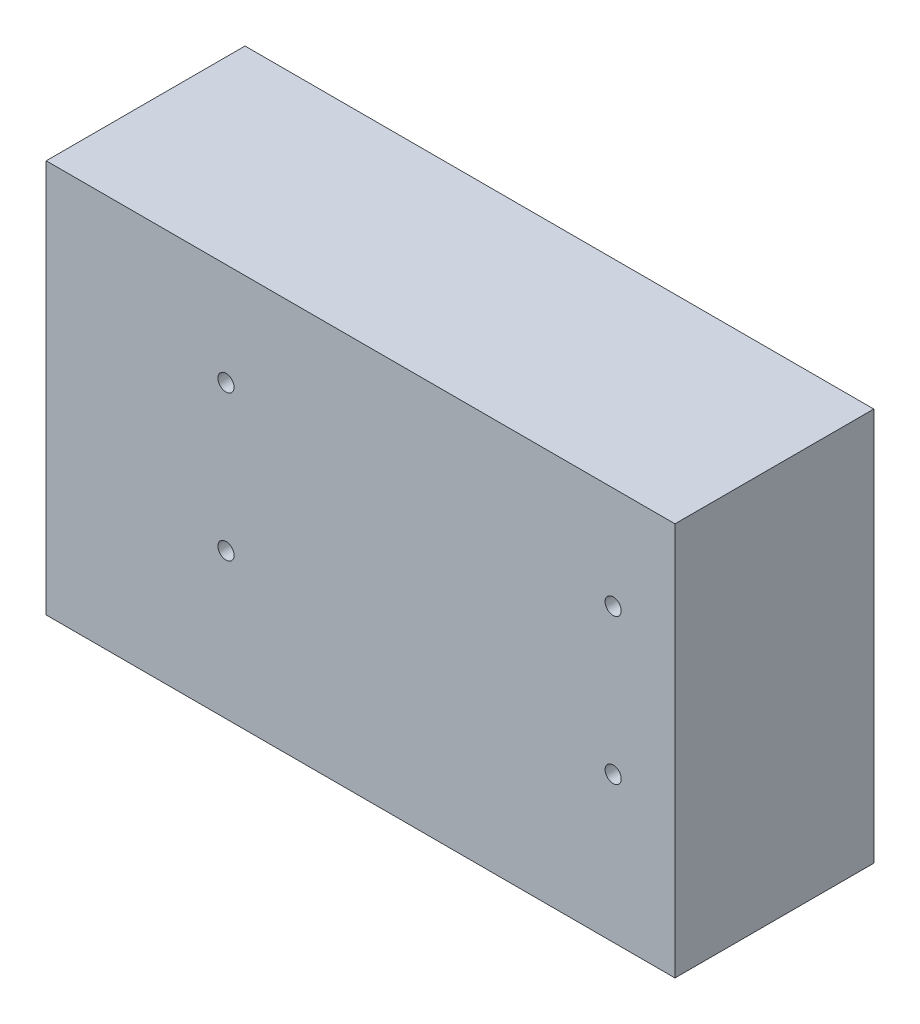
ISO-10303-21;
HEADER;
FILE_DESCRIPTION(('STEP AP214'),'2;1');
FILE_NAME('part.step','',(''),(''),'','','');
FILE_SCHEMA(('AUTOMOTIVE_DESIGN { 1 0 10303 214 1 1 1 1 }'));
ENDSEC;
DATA;
#1=APPLICATION_CONTEXT('core data for automotive mechanical design processes');
#2=APPLICATION_PROTOCOL_DEFINITION('international standard','automotive_design',2000,#1);
#3=PRODUCT_CONTEXT('',#1,'mechanical');
#4=PRODUCT('Part','Part','',(#3));
#5=PRODUCT_RELATED_PRODUCT_CATEGORY('part','',(#4));
#6=PRODUCT_DEFINITION_FORMATION('','',#4);
#7=PRODUCT_DEFINITION_CONTEXT('part definition',#1,'design');
#8=PRODUCT_DEFINITION('design','',#6,#7);
#9=PRODUCT_DEFINITION_SHAPE('','',#8);
#10=(LENGTH_UNIT() NAMED_UNIT(*) SI_UNIT(.MILLI.,.METRE.));
#11=(NAMED_UNIT(*) PLANE_ANGLE_UNIT() SI_UNIT($,.RADIAN.));
#12=(NAMED_UNIT(*) SI_UNIT($,.STERADIAN.) SOLID_ANGLE_UNIT());
#13=UNCERTAINTY_MEASURE_WITH_UNIT(LENGTH_MEASURE(1.E-05),#10,'distance_accuracy_value','');
#14=(GEOMETRIC_REPRESENTATION_CONTEXT(3) GLOBAL_UNCERTAINTY_ASSIGNED_CONTEXT((#13)) GLOBAL_UNIT_ASSIGNED_CONTEXT((#10,
#11,#12)) REPRESENTATION_CONTEXT('',''));
#15=CARTESIAN_POINT('',(0.,0.,0.));
#16=DIRECTION('',(0.,0.,1.));
#17=DIRECTION('',(1.,0.,0.));
#18=AXIS2_PLACEMENT_3D('',#15,#16,#17);
#19=CARTESIAN_POINT('',(33.05,20.675,20.9));
#20=DIRECTION('',(-1.,0.,0.));
#21=DIRECTION('',(0.,-1.,0.));
#22=AXIS2_PLACEMENT_3D('',#19,#20,#21);
#23=PLANE('',#22);
#24=DIRECTION('',(0.,1.,0.));
#25=VECTOR('',#24,1.);
#26=CARTESIAN_POINT('',(33.05,20.675,0.));
#27=LINE('',#26,#25);
#28=CARTESIAN_POINT('',(33.05,-20.675,0.));
#29=VERTEX_POINT('',#28);
#30=CARTESIAN_POINT('',(33.05,20.675,0.));
#31=VERTEX_POINT('',#30);
#32=EDGE_CURVE('E103',#29,#31,#27,.T.);
#33=ORIENTED_EDGE('',*,*,#32,.T.);
#34=DIRECTION('',(0.,0.,-1.));
#35=VECTOR('',#34,1.);
#36=CARTESIAN_POINT('',(33.05,20.675,20.9));
#37=LINE('',#36,#35);
#38=CARTESIAN_POINT('',(33.05,20.675,20.9));
#39=VERTEX_POINT('',#38);
#40=EDGE_CURVE('E11',#39,#31,#37,.T.);
#41=ORIENTED_EDGE('',*,*,#40,.F.);
#42=DIRECTION('',(0.,1.,0.));
#43=VECTOR('',#42,1.);
#44=CARTESIAN_POINT('',(33.05,20.675,20.9));
#45=LINE('',#44,#43);
#46=CARTESIAN_POINT('',(33.05,-20.675,20.9));
#47=VERTEX_POINT('',#46);
#48=EDGE_CURVE('E91',#47,#39,#45,.T.);
#49=ORIENTED_EDGE('',*,*,#48,.F.);
#50=DIRECTION('',(0.,0.,-1.));
#51=VECTOR('',#50,1.);
#52=CARTESIAN_POINT('',(33.05,-20.675,20.9));
#53=LINE('',#52,#51);
#54=EDGE_CURVE('E99',#47,#29,#53,.T.);
#55=ORIENTED_EDGE('',*,*,#54,.T.);
#56=EDGE_LOOP('',(#33,#41,#49,#55));
#57=FACE_BOUND('',#56,.T.);
#58=ADVANCED_FACE('F40',(#57),#23,.F.);
#59=CARTESIAN_POINT('',(-33.05,20.675,20.9));
#60=DIRECTION('',(0.,-1.,0.));
#61=DIRECTION('',(1.,0.,0.));
#62=AXIS2_PLACEMENT_3D('',#59,#60,#61);
#63=PLANE('',#62);
#64=DIRECTION('',(-1.,0.,0.));
#65=VECTOR('',#64,1.);
#66=CARTESIAN_POINT('',(-33.05,20.675,0.));
#67=LINE('',#66,#65);
#68=CARTESIAN_POINT('',(-33.05,20.675,0.));
#69=VERTEX_POINT('',#68);
#70=EDGE_CURVE('E95',#31,#69,#67,.T.);
#71=ORIENTED_EDGE('',*,*,#70,.T.);
#72=DIRECTION('',(0.,0.,-1.));
#73=VECTOR('',#72,1.);
#74=CARTESIAN_POINT('',(-33.05,20.675,20.9));
#75=LINE('',#74,#73);
#76=CARTESIAN_POINT('',(-33.05,20.675,20.9));
#77=VERTEX_POINT('',#76);
#78=EDGE_CURVE('E48',#77,#69,#75,.T.);
#79=ORIENTED_EDGE('',*,*,#78,.F.);
#80=DIRECTION('',(-1.,0.,0.));
#81=VECTOR('',#80,1.);
#82=CARTESIAN_POINT('',(-33.05,20.675,20.9));
#83=LINE('',#82,#81);
#84=EDGE_CURVE('E86',#39,#77,#83,.T.);
#85=ORIENTED_EDGE('',*,*,#84,.F.);
#86=ORIENTED_EDGE('',*,*,#40,.T.);
#87=EDGE_LOOP('',(#71,#79,#85,#86));
#88=FACE_BOUND('',#87,.T.);
#89=ADVANCED_FACE('F94',(#88),#63,.F.);
#90=CARTESIAN_POINT('',(-33.05,20.675,20.9));
#91=DIRECTION('',(1.,0.,0.));
#92=DIRECTION('',(0.,1.,0.));
#93=AXIS2_PLACEMENT_3D('',#90,#91,#92);
#94=PLANE('',#93);
#95=DIRECTION('',(0.,-1.,0.));
#96=VECTOR('',#95,1.);
#97=CARTESIAN_POINT('',(-33.05,20.675,0.));
#98=LINE('',#97,#96);
#99=CARTESIAN_POINT('',(-33.05,-20.675,0.));
#100=VERTEX_POINT('',#99);
#101=EDGE_CURVE('E73',#69,#100,#98,.T.);
#102=ORIENTED_EDGE('',*,*,#101,.T.);
#103=DIRECTION('',(0.,0.,-1.));
#104=VECTOR('',#103,1.);
#105=CARTESIAN_POINT('',(-33.05,-20.675,20.9));
#106=LINE('',#105,#104);
#107=CARTESIAN_POINT('',(-33.05,-20.675,20.9));
#108=VERTEX_POINT('',#107);
#109=EDGE_CURVE('E96',#108,#100,#106,.T.);
#110=ORIENTED_EDGE('',*,*,#109,.F.);
#111=DIRECTION('',(0.,-1.,0.));
#112=VECTOR('',#111,1.);
#113=CARTESIAN_POINT('',(-33.05,20.675,20.9));
#114=LINE('',#113,#112);
#115=EDGE_CURVE('E89',#77,#108,#114,.T.);
#116=ORIENTED_EDGE('',*,*,#115,.F.);
#117=ORIENTED_EDGE('',*,*,#78,.T.);
#118=EDGE_LOOP('',(#102,#110,#116,#117));
#119=FACE_BOUND('',#118,.T.);
#120=ADVANCED_FACE('F97',(#119),#94,.F.);
#121=CARTESIAN_POINT('',(-33.05,-20.675,20.9));
#122=DIRECTION('',(0.,1.,0.));
#123=DIRECTION('',(0.,0.,1.));
#124=AXIS2_PLACEMENT_3D('',#121,#122,#123);
#125=PLANE('',#124);
#126=DIRECTION('',(1.,0.,0.));
#127=VECTOR('',#126,1.);
#128=CARTESIAN_POINT('',(-33.05,-20.675,0.));
#129=LINE('',#128,#127);
#130=EDGE_CURVE('E79',#100,#29,#129,.T.);
#131=ORIENTED_EDGE('',*,*,#130,.T.);
#132=ORIENTED_EDGE('',*,*,#54,.F.);
#133=DIRECTION('',(1.,0.,0.));
#134=VECTOR('',#133,1.);
#135=CARTESIAN_POINT('',(-33.05,-20.675,20.9));
#136=LINE('',#135,#134);
#137=EDGE_CURVE('E56',#108,#47,#136,.T.);
#138=ORIENTED_EDGE('',*,*,#137,.F.);
#139=ORIENTED_EDGE('',*,*,#109,.T.);
#140=EDGE_LOOP('',(#131,#132,#138,#139));
#141=FACE_BOUND('',#140,.T.);
#142=ADVANCED_FACE('F111',(#141),#125,.F.);
#143=CARTESIAN_POINT('',(0.,0.,20.9));
#144=DIRECTION('',(0.,0.,1.));
#145=DIRECTION('',(1.,0.,0.));
#146=AXIS2_PLACEMENT_3D('',#143,#144,#145);
#147=PLANE('',#146);
#148=CARTESIAN_POINT('',(-14.15,9.925,20.9));
#149=DIRECTION('',(0.,0.,1.));
#150=DIRECTION('',(1.,0.,0.));
#151=AXIS2_PLACEMENT_3D('',#148,#149,#150);
#152=CIRCLE('',#151,0.85);
#153=CARTESIAN_POINT('',(-13.3,9.925,20.9));
#154=VERTEX_POINT('',#153);
#155=EDGE_CURVE('E106',#154,#154,#152,.T.);
#156=ORIENTED_EDGE('',*,*,#155,.F.);
#157=EDGE_LOOP('',(#156));
#158=FACE_BOUND('',#157,.T.);
#159=CARTESIAN_POINT('',(26.55,-5.375,20.9));
#160=DIRECTION('',(0.,0.,1.));
#161=DIRECTION('',(1.,0.,0.));
#162=AXIS2_PLACEMENT_3D('',#159,#160,#161);
#163=CIRCLE('',#162,0.85);
#164=CARTESIAN_POINT('',(27.4,-5.375,20.9));
#165=VERTEX_POINT('',#164);
#166=EDGE_CURVE('E119',#165,#165,#163,.T.);
#167=ORIENTED_EDGE('',*,*,#166,.F.);
#168=EDGE_LOOP('',(#167));
#169=FACE_BOUND('',#168,.T.);
#170=CARTESIAN_POINT('',(-14.15,-5.375,20.9));
#171=DIRECTION('',(0.,0.,1.));
#172=DIRECTION('',(1.,0.,0.));
#173=AXIS2_PLACEMENT_3D('',#170,#171,#172);
#174=CIRCLE('',#173,0.85);
#175=CARTESIAN_POINT('',(-13.3,-5.375,20.9));
#176=VERTEX_POINT('',#175);
#177=EDGE_CURVE('E122',#176,#176,#174,.T.);
#178=ORIENTED_EDGE('',*,*,#177,.F.);
#179=EDGE_LOOP('',(#178));
#180=FACE_BOUND('',#179,.T.);
#181=CARTESIAN_POINT('',(26.55,9.925,20.9));
#182=DIRECTION('',(0.,0.,1.));
#183=DIRECTION('',(1.,0.,0.));
#184=AXIS2_PLACEMENT_3D('',#181,#182,#183);
#185=CIRCLE('',#184,0.85);
#186=CARTESIAN_POINT('',(27.4,9.925,20.9));
#187=VERTEX_POINT('',#186);
#188=EDGE_CURVE('E125',#187,#187,#185,.T.);
#189=ORIENTED_EDGE('',*,*,#188,.F.);
#190=EDGE_LOOP('',(#189));
#191=FACE_BOUND('',#190,.T.);
#192=ORIENTED_EDGE('',*,*,#48,.T.);
#193=ORIENTED_EDGE('',*,*,#84,.T.);
#194=ORIENTED_EDGE('',*,*,#115,.T.);
#195=ORIENTED_EDGE('',*,*,#137,.T.);
#196=EDGE_LOOP('',(#192,#193,#194,#195));
#197=FACE_BOUND('',#196,.T.);
#198=ADVANCED_FACE('F87',(#158,#169,#180,#191,#197),#147,.T.);
#199=CARTESIAN_POINT('',(0.,0.,0.));
#200=DIRECTION('',(0.,0.,1.));
#201=DIRECTION('',(1.,0.,0.));
#202=AXIS2_PLACEMENT_3D('',#199,#200,#201);
#203=PLANE('',#202);
#204=CARTESIAN_POINT('',(-14.15,9.925,0.));
#205=DIRECTION('',(0.,0.,-1.));
#206=DIRECTION('',(-1.,0.,0.));
#207=AXIS2_PLACEMENT_3D('',#204,#205,#206);
#208=CIRCLE('',#207,0.85);
#209=CARTESIAN_POINT('',(-15.,9.925,0.));
#210=VERTEX_POINT('',#209);
#211=EDGE_CURVE('E131',#210,#210,#208,.T.);
#212=ORIENTED_EDGE('',*,*,#211,.F.);
#213=EDGE_LOOP('',(#212));
#214=FACE_BOUND('',#213,.T.);
#215=CARTESIAN_POINT('',(26.55,-5.375,0.));
#216=DIRECTION('',(0.,0.,-1.));
#217=DIRECTION('',(-1.,0.,0.));
#218=AXIS2_PLACEMENT_3D('',#215,#216,#217);
#219=CIRCLE('',#218,0.85);
#220=CARTESIAN_POINT('',(25.7,-5.375,0.));
#221=VERTEX_POINT('',#220);
#222=EDGE_CURVE('E132',#221,#221,#219,.T.);
#223=ORIENTED_EDGE('',*,*,#222,.F.);
#224=EDGE_LOOP('',(#223));
#225=FACE_BOUND('',#224,.T.);
#226=CARTESIAN_POINT('',(-14.15,-5.375,0.));
#227=DIRECTION('',(0.,0.,-1.));
#228=DIRECTION('',(-1.,0.,0.));
#229=AXIS2_PLACEMENT_3D('',#226,#227,#228);
#230=CIRCLE('',#229,0.85);
#231=CARTESIAN_POINT('',(-15.,-5.375,0.));
#232=VERTEX_POINT('',#231);
#233=EDGE_CURVE('E135',#232,#232,#230,.T.);
#234=ORIENTED_EDGE('',*,*,#233,.F.);
#235=EDGE_LOOP('',(#234));
#236=FACE_BOUND('',#235,.T.);
#237=CARTESIAN_POINT('',(26.55,9.925,0.));
#238=DIRECTION('',(0.,0.,-1.));
#239=DIRECTION('',(-1.,0.,0.));
#240=AXIS2_PLACEMENT_3D('',#237,#238,#239);
#241=CIRCLE('',#240,0.85);
#242=CARTESIAN_POINT('',(25.7,9.925,0.));
#243=VERTEX_POINT('',#242);
#244=EDGE_CURVE('E128',#243,#243,#241,.T.);
#245=ORIENTED_EDGE('',*,*,#244,.F.);
#246=EDGE_LOOP('',(#245));
#247=FACE_BOUND('',#246,.T.);
#248=ORIENTED_EDGE('',*,*,#32,.F.);
#249=ORIENTED_EDGE('',*,*,#130,.F.);
#250=ORIENTED_EDGE('',*,*,#101,.F.);
#251=ORIENTED_EDGE('',*,*,#70,.F.);
#252=EDGE_LOOP('',(#248,#249,#250,#251));
#253=FACE_BOUND('',#252,.T.);
#254=ADVANCED_FACE('F114',(#214,#225,#236,#247,#253),#203,.F.);
#255=CARTESIAN_POINT('',(26.55,9.925,30.));
#256=DIRECTION('',(0.,0.,-1.));
#257=DIRECTION('',(-1.,0.,0.));
#258=AXIS2_PLACEMENT_3D('',#255,#256,#257);
#259=CYLINDRICAL_SURFACE('',#258,0.85);
#260=ORIENTED_EDGE('',*,*,#188,.T.);
#261=EDGE_LOOP('',(#260));
#262=FACE_BOUND('',#261,.T.);
#263=ORIENTED_EDGE('',*,*,#244,.T.);
#264=EDGE_LOOP('',(#263));
#265=FACE_BOUND('',#264,.T.);
#266=ADVANCED_FACE('F145',(#262,#265),#259,.F.);
#267=CARTESIAN_POINT('',(-14.15,-5.375,30.));
#268=DIRECTION('',(0.,0.,-1.));
#269=DIRECTION('',(-1.,0.,0.));
#270=AXIS2_PLACEMENT_3D('',#267,#268,#269);
#271=CYLINDRICAL_SURFACE('',#270,0.85);
#272=ORIENTED_EDGE('',*,*,#177,.T.);
#273=EDGE_LOOP('',(#272));
#274=FACE_BOUND('',#273,.T.);
#275=ORIENTED_EDGE('',*,*,#233,.T.);
#276=EDGE_LOOP('',(#275));
#277=FACE_BOUND('',#276,.T.);
#278=ADVANCED_FACE('F141',(#274,#277),#271,.F.);
#279=CARTESIAN_POINT('',(26.55,-5.375,30.));
#280=DIRECTION('',(0.,0.,-1.));
#281=DIRECTION('',(-1.,0.,0.));
#282=AXIS2_PLACEMENT_3D('',#279,#280,#281);
#283=CYLINDRICAL_SURFACE('',#282,0.85);
#284=ORIENTED_EDGE('',*,*,#166,.T.);
#285=EDGE_LOOP('',(#284));
#286=FACE_BOUND('',#285,.T.);
#287=ORIENTED_EDGE('',*,*,#222,.T.);
#288=EDGE_LOOP('',(#287));
#289=FACE_BOUND('',#288,.T.);
#290=ADVANCED_FACE('F156',(#286,#289),#283,.F.);
#291=CARTESIAN_POINT('',(-14.15,9.925,30.));
#292=DIRECTION('',(0.,0.,-1.));
#293=DIRECTION('',(-1.,0.,0.));
#294=AXIS2_PLACEMENT_3D('',#291,#292,#293);
#295=CYLINDRICAL_SURFACE('',#294,0.85);
#296=ORIENTED_EDGE('',*,*,#155,.T.);
#297=EDGE_LOOP('',(#296));
#298=FACE_BOUND('',#297,.T.);
#299=ORIENTED_EDGE('',*,*,#211,.T.);
#300=EDGE_LOOP('',(#299));
#301=FACE_BOUND('',#300,.T.);
#302=ADVANCED_FACE('F185',(#298,#301),#295,.F.);
#303=CLOSED_SHELL('',(#58,#89,#120,#142,#198,#254,#266,#278,#290,#302));
#304=MANIFOLD_SOLID_BREP('B2',#303);
#305=ADVANCED_BREP_SHAPE_REPRESENTATION('',(#18,#304),#14);
#306=SHAPE_DEFINITION_REPRESENTATION(#9,#305);
ENDSEC;
END-ISO-10303-21;
